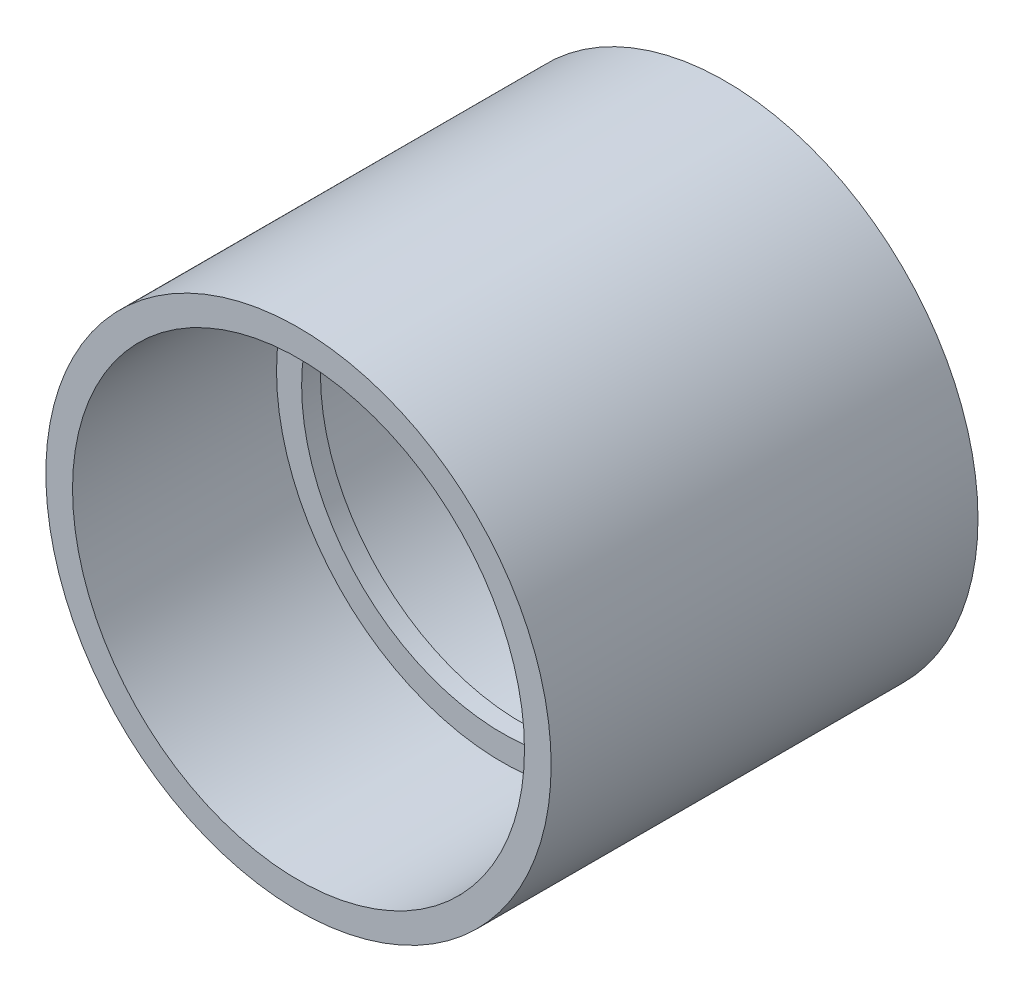
ISO-10303-21;
HEADER;
FILE_DESCRIPTION(('STEP AP214'),'2;1');
FILE_NAME('part.step','',(''),(''),'','','');
FILE_SCHEMA(('AUTOMOTIVE_DESIGN { 1 0 10303 214 1 1 1 1 }'));
ENDSEC;
DATA;
#1=APPLICATION_CONTEXT('core data for automotive mechanical design processes');
#2=APPLICATION_PROTOCOL_DEFINITION('international standard','automotive_design',2000,#1);
#3=PRODUCT_CONTEXT('',#1,'mechanical');
#4=PRODUCT('Part','Part','',(#3));
#5=PRODUCT_RELATED_PRODUCT_CATEGORY('part','',(#4));
#6=PRODUCT_DEFINITION_FORMATION('','',#4);
#7=PRODUCT_DEFINITION_CONTEXT('part definition',#1,'design');
#8=PRODUCT_DEFINITION('design','',#6,#7);
#9=PRODUCT_DEFINITION_SHAPE('','',#8);
#10=(LENGTH_UNIT() NAMED_UNIT(*) SI_UNIT(.MILLI.,.METRE.));
#11=(NAMED_UNIT(*) PLANE_ANGLE_UNIT() SI_UNIT($,.RADIAN.));
#12=(NAMED_UNIT(*) SI_UNIT($,.STERADIAN.) SOLID_ANGLE_UNIT());
#13=UNCERTAINTY_MEASURE_WITH_UNIT(LENGTH_MEASURE(1.E-05),#10,'distance_accuracy_value','');
#14=(GEOMETRIC_REPRESENTATION_CONTEXT(3) GLOBAL_UNCERTAINTY_ASSIGNED_CONTEXT((#13)) GLOBAL_UNIT_ASSIGNED_CONTEXT((#10,
#11,#12)) REPRESENTATION_CONTEXT('',''));
#15=CARTESIAN_POINT('',(0.,0.,0.));
#16=DIRECTION('',(0.,0.,1.));
#17=DIRECTION('',(1.,0.,0.));
#18=AXIS2_PLACEMENT_3D('',#15,#16,#17);
#19=CARTESIAN_POINT('',(0.,57.15,53.975));
#20=DIRECTION('',(0.,0.,-1.));
#21=DIRECTION('',(-1.,0.,0.));
#22=AXIS2_PLACEMENT_3D('',#19,#20,#21);
#23=PLANE('',#22);
#24=CARTESIAN_POINT('',(0.,0.,53.975));
#25=DIRECTION('',(0.,0.,1.));
#26=DIRECTION('',(1.,0.,0.));
#27=AXIS2_PLACEMENT_3D('',#24,#25,#26);
#28=CIRCLE('',#27,57.15);
#29=CARTESIAN_POINT('',(57.15,0.,53.975));
#30=VERTEX_POINT('',#29);
#31=EDGE_CURVE('E62',#30,#30,#28,.T.);
#32=ORIENTED_EDGE('',*,*,#31,.F.);
#33=EDGE_LOOP('',(#32));
#34=FACE_BOUND('',#33,.T.);
#35=CARTESIAN_POINT('',(0.,0.,53.975));
#36=DIRECTION('',(0.,0.,1.));
#37=DIRECTION('',(1.,0.,0.));
#38=AXIS2_PLACEMENT_3D('',#35,#36,#37);
#39=CIRCLE('',#38,63.896875);
#40=CARTESIAN_POINT('',(63.896875,0.,53.975));
#41=VERTEX_POINT('',#40);
#42=EDGE_CURVE('E10',#41,#41,#39,.T.);
#43=ORIENTED_EDGE('',*,*,#42,.T.);
#44=EDGE_LOOP('',(#43));
#45=FACE_BOUND('',#44,.T.);
#46=ADVANCED_FACE('F34',(#34,#45),#23,.F.);
#47=CARTESIAN_POINT('',(0.,0.,62.5945817490495));
#48=DIRECTION('',(0.,0.,1.));
#49=DIRECTION('',(1.,0.,0.));
#50=AXIS2_PLACEMENT_3D('',#47,#48,#49);
#51=CYLINDRICAL_SURFACE('',#50,63.896875);
#52=ORIENTED_EDGE('',*,*,#42,.F.);
#53=EDGE_LOOP('',(#52));
#54=FACE_BOUND('',#53,.T.);
#55=CARTESIAN_POINT('',(0.,0.,-53.975));
#56=DIRECTION('',(0.,0.,1.));
#57=DIRECTION('',(1.,0.,0.));
#58=AXIS2_PLACEMENT_3D('',#55,#56,#57);
#59=CIRCLE('',#58,63.896875);
#60=CARTESIAN_POINT('',(63.896875,0.,-53.975));
#61=VERTEX_POINT('',#60);
#62=EDGE_CURVE('E40',#61,#61,#59,.T.);
#63=ORIENTED_EDGE('',*,*,#62,.T.);
#64=EDGE_LOOP('',(#63));
#65=FACE_BOUND('',#64,.T.);
#66=ADVANCED_FACE('F69',(#54,#65),#51,.T.);
#67=CARTESIAN_POINT('',(0.,63.896875,-53.975));
#68=DIRECTION('',(0.,0.,1.));
#69=DIRECTION('',(1.,0.,0.));
#70=AXIS2_PLACEMENT_3D('',#67,#68,#69);
#71=PLANE('',#70);
#72=ORIENTED_EDGE('',*,*,#62,.F.);
#73=EDGE_LOOP('',(#72));
#74=FACE_BOUND('',#73,.T.);
#75=CARTESIAN_POINT('',(0.,0.,-53.975));
#76=DIRECTION('',(0.,0.,1.));
#77=DIRECTION('',(1.,0.,0.));
#78=AXIS2_PLACEMENT_3D('',#75,#76,#77);
#79=CIRCLE('',#78,57.15);
#80=CARTESIAN_POINT('',(57.15,0.,-53.975));
#81=VERTEX_POINT('',#80);
#82=EDGE_CURVE('E44',#81,#81,#79,.T.);
#83=ORIENTED_EDGE('',*,*,#82,.T.);
#84=EDGE_LOOP('',(#83));
#85=FACE_BOUND('',#84,.T.);
#86=ADVANCED_FACE('F73',(#74,#85),#71,.F.);
#87=CARTESIAN_POINT('',(0.,0.,62.5945817490495));
#88=DIRECTION('',(0.,0.,1.));
#89=DIRECTION('',(1.,0.,0.));
#90=AXIS2_PLACEMENT_3D('',#87,#88,#89);
#91=CYLINDRICAL_SURFACE('',#90,57.15);
#92=ORIENTED_EDGE('',*,*,#82,.F.);
#93=EDGE_LOOP('',(#92));
#94=FACE_BOUND('',#93,.T.);
#95=CARTESIAN_POINT('',(0.,0.,-2.38125));
#96=DIRECTION('',(0.,0.,1.));
#97=DIRECTION('',(1.,0.,0.));
#98=AXIS2_PLACEMENT_3D('',#95,#96,#97);
#99=CIRCLE('',#98,57.15);
#100=CARTESIAN_POINT('',(57.15,0.,-2.38125));
#101=VERTEX_POINT('',#100);
#102=EDGE_CURVE('E48',#101,#101,#99,.T.);
#103=ORIENTED_EDGE('',*,*,#102,.T.);
#104=EDGE_LOOP('',(#103));
#105=FACE_BOUND('',#104,.T.);
#106=ADVANCED_FACE('F78',(#94,#105),#91,.F.);
#107=CARTESIAN_POINT('',(0.,57.15,-2.38125));
#108=DIRECTION('',(0.,0.,1.));
#109=DIRECTION('',(1.,0.,0.));
#110=AXIS2_PLACEMENT_3D('',#107,#108,#109);
#111=PLANE('',#110);
#112=ORIENTED_EDGE('',*,*,#102,.F.);
#113=EDGE_LOOP('',(#112));
#114=FACE_BOUND('',#113,.T.);
#115=CARTESIAN_POINT('',(0.,0.,-2.38125));
#116=DIRECTION('',(0.,0.,1.));
#117=DIRECTION('',(1.,0.,0.));
#118=AXIS2_PLACEMENT_3D('',#115,#116,#117);
#119=CIRCLE('',#118,50.8);
#120=CARTESIAN_POINT('',(50.8,0.,-2.38125));
#121=VERTEX_POINT('',#120);
#122=EDGE_CURVE('E53',#121,#121,#119,.T.);
#123=ORIENTED_EDGE('',*,*,#122,.T.);
#124=EDGE_LOOP('',(#123));
#125=FACE_BOUND('',#124,.T.);
#126=ADVANCED_FACE('F84',(#114,#125),#111,.F.);
#127=CARTESIAN_POINT('',(0.,0.,62.5945817490495));
#128=DIRECTION('',(0.,0.,1.));
#129=DIRECTION('',(1.,0.,0.));
#130=AXIS2_PLACEMENT_3D('',#127,#128,#129);
#131=CYLINDRICAL_SURFACE('',#130,50.8);
#132=ORIENTED_EDGE('',*,*,#122,.F.);
#133=EDGE_LOOP('',(#132));
#134=FACE_BOUND('',#133,.T.);
#135=CARTESIAN_POINT('',(0.,0.,2.38125));
#136=DIRECTION('',(0.,0.,1.));
#137=DIRECTION('',(1.,0.,0.));
#138=AXIS2_PLACEMENT_3D('',#135,#136,#137);
#139=CIRCLE('',#138,50.8);
#140=CARTESIAN_POINT('',(50.8,0.,2.38125));
#141=VERTEX_POINT('',#140);
#142=EDGE_CURVE('E56',#141,#141,#139,.T.);
#143=ORIENTED_EDGE('',*,*,#142,.T.);
#144=EDGE_LOOP('',(#143));
#145=FACE_BOUND('',#144,.T.);
#146=ADVANCED_FACE('F88',(#134,#145),#131,.F.);
#147=CARTESIAN_POINT('',(0.,50.8,2.38125));
#148=DIRECTION('',(0.,0.,-1.));
#149=DIRECTION('',(-1.,0.,0.));
#150=AXIS2_PLACEMENT_3D('',#147,#148,#149);
#151=PLANE('',#150);
#152=ORIENTED_EDGE('',*,*,#142,.F.);
#153=EDGE_LOOP('',(#152));
#154=FACE_BOUND('',#153,.T.);
#155=CARTESIAN_POINT('',(0.,0.,2.38125));
#156=DIRECTION('',(0.,0.,1.));
#157=DIRECTION('',(1.,0.,0.));
#158=AXIS2_PLACEMENT_3D('',#155,#156,#157);
#159=CIRCLE('',#158,57.15);
#160=CARTESIAN_POINT('',(57.15,0.,2.38125));
#161=VERTEX_POINT('',#160);
#162=EDGE_CURVE('E59',#161,#161,#159,.T.);
#163=ORIENTED_EDGE('',*,*,#162,.T.);
#164=EDGE_LOOP('',(#163));
#165=FACE_BOUND('',#164,.T.);
#166=ADVANCED_FACE('F92',(#154,#165),#151,.F.);
#167=CARTESIAN_POINT('',(0.,0.,62.5945817490495));
#168=DIRECTION('',(0.,0.,1.));
#169=DIRECTION('',(1.,0.,0.));
#170=AXIS2_PLACEMENT_3D('',#167,#168,#169);
#171=CYLINDRICAL_SURFACE('',#170,57.15);
#172=ORIENTED_EDGE('',*,*,#162,.F.);
#173=EDGE_LOOP('',(#172));
#174=FACE_BOUND('',#173,.T.);
#175=ORIENTED_EDGE('',*,*,#31,.T.);
#176=EDGE_LOOP('',(#175));
#177=FACE_BOUND('',#176,.T.);
#178=ADVANCED_FACE('F66',(#174,#177),#171,.F.);
#179=CLOSED_SHELL('',(#46,#66,#86,#106,#126,#146,#166,#178));
#180=MANIFOLD_SOLID_BREP('B2',#179);
#181=ADVANCED_BREP_SHAPE_REPRESENTATION('',(#18,#180),#14);
#182=SHAPE_DEFINITION_REPRESENTATION(#9,#181);
ENDSEC;
END-ISO-10303-21;
